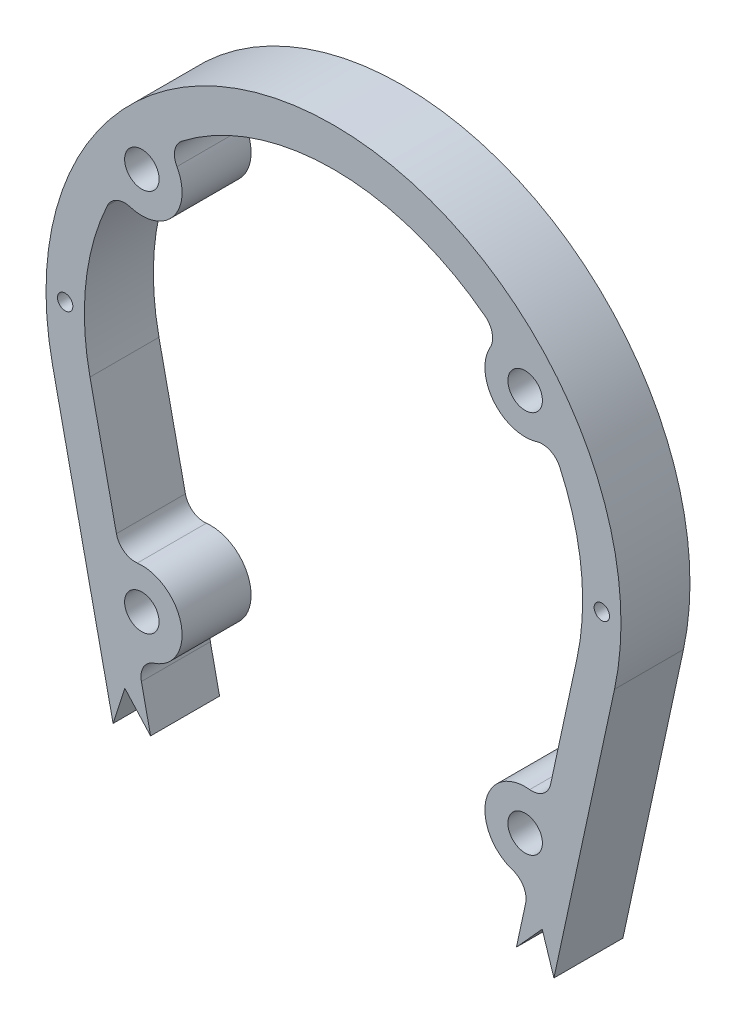
ISO-10303-21;
HEADER;
FILE_DESCRIPTION(('STEP AP214'),'2;1');
FILE_NAME('part.step','',(''),(''),'','','');
FILE_SCHEMA(('AUTOMOTIVE_DESIGN { 1 0 10303 214 1 1 1 1 }'));
ENDSEC;
DATA;
#1=APPLICATION_CONTEXT('core data for automotive mechanical design processes');
#2=APPLICATION_PROTOCOL_DEFINITION('international standard','automotive_design',2000,#1);
#3=PRODUCT_CONTEXT('',#1,'mechanical');
#4=PRODUCT('Part','Part','',(#3));
#5=PRODUCT_RELATED_PRODUCT_CATEGORY('part','',(#4));
#6=PRODUCT_DEFINITION_FORMATION('','',#4);
#7=PRODUCT_DEFINITION_CONTEXT('part definition',#1,'design');
#8=PRODUCT_DEFINITION('design','',#6,#7);
#9=PRODUCT_DEFINITION_SHAPE('','',#8);
#10=(LENGTH_UNIT() NAMED_UNIT(*) SI_UNIT(.MILLI.,.METRE.));
#11=(NAMED_UNIT(*) PLANE_ANGLE_UNIT() SI_UNIT($,.RADIAN.));
#12=(NAMED_UNIT(*) SI_UNIT($,.STERADIAN.) SOLID_ANGLE_UNIT());
#13=UNCERTAINTY_MEASURE_WITH_UNIT(LENGTH_MEASURE(1.E-05),#10,'distance_accuracy_value','');
#14=(GEOMETRIC_REPRESENTATION_CONTEXT(3) GLOBAL_UNCERTAINTY_ASSIGNED_CONTEXT((#13)) GLOBAL_UNIT_ASSIGNED_CONTEXT((#10,
#11,#12)) REPRESENTATION_CONTEXT('',''));
#15=CARTESIAN_POINT('',(0.,0.,0.));
#16=DIRECTION('',(0.,0.,1.));
#17=DIRECTION('',(1.,0.,0.));
#18=AXIS2_PLACEMENT_3D('',#15,#16,#17);
#19=CARTESIAN_POINT('',(-31.9298733487398,-112.5,18.));
#20=DIRECTION('',(0.,0.,1.));
#21=DIRECTION('',(1.,0.,0.));
#22=AXIS2_PLACEMENT_3D('',#19,#20,#21);
#23=PLANE('',#22);
#24=CARTESIAN_POINT('',(70.,47.5,18.));
#25=DIRECTION('',(0.,0.,1.));
#26=DIRECTION('',(1.,0.,0.));
#27=AXIS2_PLACEMENT_3D('',#24,#25,#26);
#28=CIRCLE('',#27,2.);
#29=CARTESIAN_POINT('',(72.,47.5,18.));
#30=VERTEX_POINT('',#29);
#31=EDGE_CURVE('E555',#30,#30,#28,.T.);
#32=ORIENTED_EDGE('',*,*,#31,.F.);
#33=EDGE_LOOP('',(#32));
#34=FACE_BOUND('',#33,.T.);
#35=CARTESIAN_POINT('',(-70.,47.5,18.));
#36=DIRECTION('',(0.,0.,1.));
#37=DIRECTION('',(1.,0.,0.));
#38=AXIS2_PLACEMENT_3D('',#35,#36,#37);
#39=CIRCLE('',#38,2.);
#40=CARTESIAN_POINT('',(-68.,47.5,18.));
#41=VERTEX_POINT('',#40);
#42=EDGE_CURVE('E549',#41,#41,#39,.T.);
#43=ORIENTED_EDGE('',*,*,#42,.F.);
#44=EDGE_LOOP('',(#43));
#45=FACE_BOUND('',#44,.T.);
#46=DIRECTION('',(-0.306753150837407,-0.95178910713,0.));
#47=VECTOR('',#46,1.);
#48=CARTESIAN_POINT('',(-57.5063561450649,-41.4755483598365,18.));
#49=LINE('',#48,#47);
#50=CARTESIAN_POINT('',(-54.4439824625953,-31.9736609139237,18.));
#51=VERTEX_POINT('',#50);
#52=CARTESIAN_POINT('',(-57.5063561450649,-41.4755483598365,18.));
#53=VERTEX_POINT('',#52);
#54=EDGE_CURVE('E215',#51,#53,#49,.T.);
#55=ORIENTED_EDGE('',*,*,#54,.F.);
#56=DIRECTION('',(-0.67089697040122,0.741550574881083,0.));
#57=VECTOR('',#56,1.);
#58=CARTESIAN_POINT('',(-54.4439824625953,-31.9736609139237,18.));
#59=LINE('',#58,#57);
#60=CARTESIAN_POINT('',(-47.7236876934698,-39.4016843948391,18.));
#61=VERTEX_POINT('',#60);
#62=EDGE_CURVE('E540',#61,#51,#59,.T.);
#63=ORIENTED_EDGE('',*,*,#62,.F.);
#64=DIRECTION('',(0.211189373172623,-0.977445164016353,0.));
#65=VECTOR('',#64,1.);
#66=CARTESIAN_POINT('',(-31.9298733487398,-112.5,18.));
#67=LINE('',#66,#65);
#68=CARTESIAN_POINT('',(-50.1212592306133,-28.3050337009208,18.));
#69=VERTEX_POINT('',#68);
#70=EDGE_CURVE('E361',#69,#61,#67,.T.);
#71=ORIENTED_EDGE('',*,*,#70,.F.);
#72=CARTESIAN_POINT('',(-45.2340334105316,-27.2490868350576,18.));
#73=DIRECTION('',(0.,0.,1.));
#74=DIRECTION('',(1.,0.,0.));
#75=AXIS2_PLACEMENT_3D('',#72,#73,#74);
#76=CIRCLE('',#75,5.);
#77=CARTESIAN_POINT('',(-46.7714419877795,-22.4913168882649,18.));
#78=VERTEX_POINT('',#77);
#79=EDGE_CURVE('E303',#69,#78,#76,.F.);
#80=ORIENTED_EDGE('',*,*,#79,.T.);
#81=CARTESIAN_POINT('',(-50.,-12.5,18.));
#82=DIRECTION('',(0.,0.,-1.));
#83=DIRECTION('',(1.,0.,0.));
#84=AXIS2_PLACEMENT_3D('',#81,#82,#83);
#85=CIRCLE('',#84,10.5);
#86=CARTESIAN_POINT('',(-51.1843712947804,-2.06701075261266,18.));
#87=VERTEX_POINT('',#86);
#88=EDGE_CURVE('E358',#87,#78,#85,.T.);
#89=ORIENTED_EDGE('',*,*,#88,.F.);
#90=CARTESIAN_POINT('',(-51.7483576256283,2.90107936519085,18.));
#91=DIRECTION('',(0.,0.,1.));
#92=DIRECTION('',(1.,0.,0.));
#93=AXIS2_PLACEMENT_3D('',#90,#91,#92);
#94=CIRCLE('',#93,5.);
#95=CARTESIAN_POINT('',(-56.63558344571,1.84513249932773,18.));
#96=VERTEX_POINT('',#95);
#97=EDGE_CURVE('E290',#87,#96,#94,.F.);
#98=ORIENTED_EDGE('',*,*,#97,.T.);
#99=DIRECTION('',(0.211189373172623,-0.977445164016353,0.));
#100=VECTOR('',#99,1.);
#101=CARTESIAN_POINT('',(-55.4723236772757,-3.53876830055558,18.));
#102=LINE('',#101,#100);
#103=CARTESIAN_POINT('',(-63.5339356610629,33.7726907437795,18.));
#104=VERTEX_POINT('',#103);
#105=EDGE_CURVE('E349',#104,#96,#102,.T.);
#106=ORIENTED_EDGE('',*,*,#105,.F.);
#107=CARTESIAN_POINT('',(0.,47.5,18.));
#108=DIRECTION('',(0.,0.,1.));
#109=DIRECTION('',(1.,0.,0.));
#110=AXIS2_PLACEMENT_3D('',#107,#108,#109);
#111=CIRCLE('',#110,65.);
#112=CARTESIAN_POINT('',(-59.0097536999229,74.755255791763,18.));
#113=VERTEX_POINT('',#112);
#114=EDGE_CURVE('E343',#113,#104,#111,.T.);
#115=ORIENTED_EDGE('',*,*,#114,.F.);
#116=CARTESIAN_POINT('',(-54.4705418768519,72.6586976539351,18.));
#117=DIRECTION('',(0.,0.,1.));
#118=DIRECTION('',(1.,0.,0.));
#119=AXIS2_PLACEMENT_3D('',#116,#117,#118);
#120=CIRCLE('',#119,5.);
#121=CARTESIAN_POINT('',(-53.0284315939965,77.4462145397625,18.));
#122=VERTEX_POINT('',#121);
#123=EDGE_CURVE('E11',#113,#122,#120,.F.);
#124=ORIENTED_EDGE('',*,*,#123,.T.);
#125=CARTESIAN_POINT('',(-50.,87.5,18.));
#126=DIRECTION('',(0.,0.,-1.));
#127=DIRECTION('',(1.,0.,0.));
#128=AXIS2_PLACEMENT_3D('',#125,#126,#127);
#129=CIRCLE('',#128,10.5);
#130=CARTESIAN_POINT('',(-40.8562064862553,92.661495924439,18.));
#131=VERTEX_POINT('',#130);
#132=EDGE_CURVE('E340',#131,#122,#129,.T.);
#133=ORIENTED_EDGE('',*,*,#132,.F.);
#134=CARTESIAN_POINT('',(-36.5020190987578,95.1193511265528,18.));
#135=DIRECTION('',(0.,0.,1.));
#136=DIRECTION('',(1.,0.,0.));
#137=AXIS2_PLACEMENT_3D('',#134,#135,#136);
#138=CIRCLE('',#137,5.);
#139=CARTESIAN_POINT('',(-39.5438540236543,99.0876303870988,18.));
#140=VERTEX_POINT('',#139);
#141=EDGE_CURVE('E315',#131,#140,#138,.F.);
#142=ORIENTED_EDGE('',*,*,#141,.T.);
#143=CARTESIAN_POINT('',(0.,47.5,18.));
#144=DIRECTION('',(0.,0.,1.));
#145=DIRECTION('',(1.,0.,0.));
#146=AXIS2_PLACEMENT_3D('',#143,#144,#145);
#147=CIRCLE('',#146,65.);
#148=CARTESIAN_POINT('',(39.5438540236543,99.0876303870988,18.));
#149=VERTEX_POINT('',#148);
#150=EDGE_CURVE('E347',#149,#140,#147,.T.);
#151=ORIENTED_EDGE('',*,*,#150,.F.);
#152=CARTESIAN_POINT('',(36.5020190987578,95.1193511265527,18.));
#153=DIRECTION('',(0.,0.,1.));
#154=DIRECTION('',(1.,0.,0.));
#155=AXIS2_PLACEMENT_3D('',#152,#153,#154);
#156=CIRCLE('',#155,5.);
#157=CARTESIAN_POINT('',(40.8562064862553,92.6614959244389,18.));
#158=VERTEX_POINT('',#157);
#159=EDGE_CURVE('E311',#149,#158,#156,.F.);
#160=ORIENTED_EDGE('',*,*,#159,.T.);
#161=CARTESIAN_POINT('',(50.,87.5,18.));
#162=DIRECTION('',(0.,0.,-1.));
#163=DIRECTION('',(1.,0.,0.));
#164=AXIS2_PLACEMENT_3D('',#161,#162,#163);
#165=CIRCLE('',#164,10.5);
#166=CARTESIAN_POINT('',(53.0284315939965,77.4462145397625,18.));
#167=VERTEX_POINT('',#166);
#168=EDGE_CURVE('E352',#167,#158,#165,.T.);
#169=ORIENTED_EDGE('',*,*,#168,.F.);
#170=CARTESIAN_POINT('',(54.470541876852,72.6586976539351,18.));
#171=DIRECTION('',(0.,0.,1.));
#172=DIRECTION('',(1.,0.,0.));
#173=AXIS2_PLACEMENT_3D('',#170,#171,#172);
#174=CIRCLE('',#173,5.);
#175=CARTESIAN_POINT('',(59.009753699923,74.755255791763,18.));
#176=VERTEX_POINT('',#175);
#177=EDGE_CURVE('E307',#167,#176,#174,.F.);
#178=ORIENTED_EDGE('',*,*,#177,.T.);
#179=CARTESIAN_POINT('',(0.,47.5,18.));
#180=DIRECTION('',(0.,0.,1.));
#181=DIRECTION('',(1.,0.,0.));
#182=AXIS2_PLACEMENT_3D('',#179,#180,#181);
#183=CIRCLE('',#182,65.);
#184=CARTESIAN_POINT('',(63.5339356610629,33.7726907437795,18.));
#185=VERTEX_POINT('',#184);
#186=EDGE_CURVE('E443',#185,#176,#183,.T.);
#187=ORIENTED_EDGE('',*,*,#186,.F.);
#188=DIRECTION('',(0.211189373172623,0.977445164016353,0.));
#189=VECTOR('',#188,1.);
#190=CARTESIAN_POINT('',(55.4723236772757,-3.53876830055554,18.));
#191=LINE('',#190,#189);
#192=CARTESIAN_POINT('',(56.63558344571,1.84513249932773,18.));
#193=VERTEX_POINT('',#192);
#194=EDGE_CURVE('E441',#193,#185,#191,.T.);
#195=ORIENTED_EDGE('',*,*,#194,.F.);
#196=CARTESIAN_POINT('',(51.7483576256282,2.90107936519085,18.));
#197=DIRECTION('',(0.,0.,1.));
#198=DIRECTION('',(1.,0.,0.));
#199=AXIS2_PLACEMENT_3D('',#196,#197,#198);
#200=CIRCLE('',#199,5.);
#201=CARTESIAN_POINT('',(51.1843712947804,-2.06701075261265,18.));
#202=VERTEX_POINT('',#201);
#203=EDGE_CURVE('E294',#193,#202,#200,.F.);
#204=ORIENTED_EDGE('',*,*,#203,.T.);
#205=CARTESIAN_POINT('',(50.,-12.5,18.));
#206=DIRECTION('',(0.,0.,-1.));
#207=DIRECTION('',(1.,0.,0.));
#208=AXIS2_PLACEMENT_3D('',#205,#206,#207);
#209=CIRCLE('',#208,10.5);
#210=CARTESIAN_POINT('',(46.7714419877795,-22.4913168882648,18.));
#211=VERTEX_POINT('',#210);
#212=EDGE_CURVE('E391',#211,#202,#209,.T.);
#213=ORIENTED_EDGE('',*,*,#212,.F.);
#214=CARTESIAN_POINT('',(45.2340334105316,-27.2490868350576,18.));
#215=DIRECTION('',(0.,0.,1.));
#216=DIRECTION('',(1.,0.,0.));
#217=AXIS2_PLACEMENT_3D('',#214,#215,#216);
#218=CIRCLE('',#217,5.);
#219=CARTESIAN_POINT('',(50.1212592306133,-28.3050337009207,18.));
#220=VERTEX_POINT('',#219);
#221=EDGE_CURVE('E298',#211,#220,#218,.F.);
#222=ORIENTED_EDGE('',*,*,#221,.T.);
#223=DIRECTION('',(0.211189373172623,0.977445164016353,0.));
#224=VECTOR('',#223,1.);
#225=CARTESIAN_POINT('',(31.9298733487398,-112.5,18.));
#226=LINE('',#225,#224);
#227=CARTESIAN_POINT('',(47.7244032118376,-39.3983727700264,18.));
#228=VERTEX_POINT('',#227);
#229=EDGE_CURVE('E364',#228,#220,#226,.T.);
#230=ORIENTED_EDGE('',*,*,#229,.F.);
#231=DIRECTION('',(-0.670959777554308,-0.741493747043273,0.));
#232=VECTOR('',#231,1.);
#233=CARTESIAN_POINT('',(47.7244032118376,-39.3983727700264,18.));
#234=LINE('',#233,#232);
#235=CARTESIAN_POINT('',(54.4443390688109,-31.9720104377862,18.));
#236=VERTEX_POINT('',#235);
#237=EDGE_CURVE('E55',#236,#228,#234,.T.);
#238=ORIENTED_EDGE('',*,*,#237,.F.);
#239=DIRECTION('',(-0.306672532909785,0.951815085801174,0.));
#240=VECTOR('',#239,1.);
#241=CARTESIAN_POINT('',(54.4443390688109,-31.9720104377862,18.));
#242=LINE('',#241,#240);
#243=CARTESIAN_POINT('',(57.5063561450649,-41.4755483598365,18.));
#244=VERTEX_POINT('',#243);
#245=EDGE_CURVE('E539',#244,#236,#242,.T.);
#246=ORIENTED_EDGE('',*,*,#245,.F.);
#247=DIRECTION('',(0.211189373172623,0.977445164016353,0.));
#248=VECTOR('',#247,1.);
#249=CARTESIAN_POINT('',(41.7043249889033,-114.611893731726,18.));
#250=LINE('',#249,#248);
#251=CARTESIAN_POINT('',(73.3083873012265,31.6607970120533,18.));
#252=VERTEX_POINT('',#251);
#253=EDGE_CURVE('E223',#244,#252,#250,.T.);
#254=ORIENTED_EDGE('',*,*,#253,.T.);
#255=CARTESIAN_POINT('',(0.,47.5,18.));
#256=DIRECTION('',(0.,0.,1.));
#257=DIRECTION('',(1.,0.,0.));
#258=AXIS2_PLACEMENT_3D('',#255,#256,#257);
#259=CIRCLE('',#258,75.);
#260=CARTESIAN_POINT('',(-73.3083873012264,31.6607970120533,18.));
#261=VERTEX_POINT('',#260);
#262=EDGE_CURVE('E416',#252,#261,#259,.T.);
#263=ORIENTED_EDGE('',*,*,#262,.T.);
#264=DIRECTION('',(0.211189373172623,-0.977445164016353,0.));
#265=VECTOR('',#264,1.);
#266=CARTESIAN_POINT('',(-73.3083873012264,31.6607970120533,18.));
#267=LINE('',#266,#265);
#268=EDGE_CURVE('E238',#261,#53,#267,.T.);
#269=ORIENTED_EDGE('',*,*,#268,.T.);
#270=EDGE_LOOP('',(#55,#63,#71,#80,#89,#98,#106,#115,#124,#133,#142,#151,#160,#169,#178,#187,
#195,#204,#213,#222,#230,#238,#246,#254,#263,#269));
#271=FACE_BOUND('',#270,.T.);
#272=CARTESIAN_POINT('',(-50.,87.5,18.));
#273=DIRECTION('',(0.,0.,1.));
#274=DIRECTION('',(1.,0.,0.));
#275=AXIS2_PLACEMENT_3D('',#272,#273,#274);
#276=CIRCLE('',#275,4.5);
#277=CARTESIAN_POINT('',(-45.5,87.5,18.));
#278=VERTEX_POINT('',#277);
#279=EDGE_CURVE('E403',#278,#278,#276,.T.);
#280=ORIENTED_EDGE('',*,*,#279,.F.);
#281=EDGE_LOOP('',(#280));
#282=FACE_BOUND('',#281,.T.);
#283=CARTESIAN_POINT('',(50.,-12.5,18.));
#284=DIRECTION('',(0.,0.,1.));
#285=DIRECTION('',(1.,0.,0.));
#286=AXIS2_PLACEMENT_3D('',#283,#284,#285);
#287=CIRCLE('',#286,4.5);
#288=CARTESIAN_POINT('',(54.5,-12.5,18.));
#289=VERTEX_POINT('',#288);
#290=EDGE_CURVE('E230',#289,#289,#287,.T.);
#291=ORIENTED_EDGE('',*,*,#290,.F.);
#292=EDGE_LOOP('',(#291));
#293=FACE_BOUND('',#292,.T.);
#294=CARTESIAN_POINT('',(50.,87.5,18.));
#295=DIRECTION('',(0.,0.,1.));
#296=DIRECTION('',(1.,0.,0.));
#297=AXIS2_PLACEMENT_3D('',#294,#295,#296);
#298=CIRCLE('',#297,4.5);
#299=CARTESIAN_POINT('',(54.5,87.5,18.));
#300=VERTEX_POINT('',#299);
#301=EDGE_CURVE('E409',#300,#300,#298,.T.);
#302=ORIENTED_EDGE('',*,*,#301,.F.);
#303=EDGE_LOOP('',(#302));
#304=FACE_BOUND('',#303,.T.);
#305=CARTESIAN_POINT('',(-50.,-12.5,18.));
#306=DIRECTION('',(0.,0.,1.));
#307=DIRECTION('',(1.,0.,0.));
#308=AXIS2_PLACEMENT_3D('',#305,#306,#307);
#309=CIRCLE('',#308,4.5);
#310=CARTESIAN_POINT('',(-45.5,-12.5,18.));
#311=VERTEX_POINT('',#310);
#312=EDGE_CURVE('E397',#311,#311,#309,.T.);
#313=ORIENTED_EDGE('',*,*,#312,.F.);
#314=EDGE_LOOP('',(#313));
#315=FACE_BOUND('',#314,.T.);
#316=ADVANCED_FACE('F32',(#34,#45,#271,#282,#293,#304,#315),#23,.T.);
#317=CARTESIAN_POINT('',(-31.9298733487398,-112.5,0.));
#318=DIRECTION('',(0.,0.,1.));
#319=DIRECTION('',(1.,0.,0.));
#320=AXIS2_PLACEMENT_3D('',#317,#318,#319);
#321=PLANE('',#320);
#322=CARTESIAN_POINT('',(70.,47.5,0.));
#323=DIRECTION('',(0.,0.,1.));
#324=DIRECTION('',(1.,0.,0.));
#325=AXIS2_PLACEMENT_3D('',#322,#323,#324);
#326=CIRCLE('',#325,2.);
#327=CARTESIAN_POINT('',(72.,47.5,0.));
#328=VERTEX_POINT('',#327);
#329=EDGE_CURVE('E552',#328,#328,#326,.T.);
#330=ORIENTED_EDGE('',*,*,#329,.T.);
#331=EDGE_LOOP('',(#330));
#332=FACE_BOUND('',#331,.T.);
#333=CARTESIAN_POINT('',(-70.,47.5,0.));
#334=DIRECTION('',(0.,0.,1.));
#335=DIRECTION('',(1.,0.,0.));
#336=AXIS2_PLACEMENT_3D('',#333,#334,#335);
#337=CIRCLE('',#336,2.);
#338=CARTESIAN_POINT('',(-68.,47.5,0.));
#339=VERTEX_POINT('',#338);
#340=EDGE_CURVE('E543',#339,#339,#337,.T.);
#341=ORIENTED_EDGE('',*,*,#340,.T.);
#342=EDGE_LOOP('',(#341));
#343=FACE_BOUND('',#342,.T.);
#344=CARTESIAN_POINT('',(-50.,-12.5,0.));
#345=DIRECTION('',(0.,0.,1.));
#346=DIRECTION('',(1.,0.,0.));
#347=AXIS2_PLACEMENT_3D('',#344,#345,#346);
#348=CIRCLE('',#347,4.5);
#349=CARTESIAN_POINT('',(-45.5,-12.5,0.));
#350=VERTEX_POINT('',#349);
#351=EDGE_CURVE('E396',#350,#350,#348,.T.);
#352=ORIENTED_EDGE('',*,*,#351,.T.);
#353=EDGE_LOOP('',(#352));
#354=FACE_BOUND('',#353,.T.);
#355=CARTESIAN_POINT('',(-50.,87.5,0.));
#356=DIRECTION('',(0.,0.,1.));
#357=DIRECTION('',(1.,0.,0.));
#358=AXIS2_PLACEMENT_3D('',#355,#356,#357);
#359=CIRCLE('',#358,4.5);
#360=CARTESIAN_POINT('',(-45.5,87.5,0.));
#361=VERTEX_POINT('',#360);
#362=EDGE_CURVE('E400',#361,#361,#359,.T.);
#363=ORIENTED_EDGE('',*,*,#362,.T.);
#364=EDGE_LOOP('',(#363));
#365=FACE_BOUND('',#364,.T.);
#366=CARTESIAN_POINT('',(50.,87.5,0.));
#367=DIRECTION('',(0.,0.,1.));
#368=DIRECTION('',(1.,0.,0.));
#369=AXIS2_PLACEMENT_3D('',#366,#367,#368);
#370=CIRCLE('',#369,4.5);
#371=CARTESIAN_POINT('',(54.5,87.5,0.));
#372=VERTEX_POINT('',#371);
#373=EDGE_CURVE('E406',#372,#372,#370,.T.);
#374=ORIENTED_EDGE('',*,*,#373,.T.);
#375=EDGE_LOOP('',(#374));
#376=FACE_BOUND('',#375,.T.);
#377=CARTESIAN_POINT('',(50.,-12.5,0.));
#378=DIRECTION('',(0.,0.,1.));
#379=DIRECTION('',(1.,0.,0.));
#380=AXIS2_PLACEMENT_3D('',#377,#378,#379);
#381=CIRCLE('',#380,4.5);
#382=CARTESIAN_POINT('',(54.5,-12.5,0.));
#383=VERTEX_POINT('',#382);
#384=EDGE_CURVE('E235',#383,#383,#381,.T.);
#385=ORIENTED_EDGE('',*,*,#384,.T.);
#386=EDGE_LOOP('',(#385));
#387=FACE_BOUND('',#386,.T.);
#388=DIRECTION('',(-0.67089697040122,0.741550574881083,0.));
#389=VECTOR('',#388,1.);
#390=CARTESIAN_POINT('',(-54.4439824625953,-31.9736609139237,0.));
#391=LINE('',#390,#389);
#392=CARTESIAN_POINT('',(-47.7236876934698,-39.4016843948391,0.));
#393=VERTEX_POINT('',#392);
#394=CARTESIAN_POINT('',(-54.4439824625953,-31.9736609139237,0.));
#395=VERTEX_POINT('',#394);
#396=EDGE_CURVE('E47',#393,#395,#391,.T.);
#397=ORIENTED_EDGE('',*,*,#396,.T.);
#398=DIRECTION('',(-0.306753150837407,-0.95178910713,0.));
#399=VECTOR('',#398,1.);
#400=CARTESIAN_POINT('',(-57.5063561450649,-41.4755483598365,0.));
#401=LINE('',#400,#399);
#402=CARTESIAN_POINT('',(-57.5063561450649,-41.4755483598365,0.));
#403=VERTEX_POINT('',#402);
#404=EDGE_CURVE('E224',#395,#403,#401,.T.);
#405=ORIENTED_EDGE('',*,*,#404,.T.);
#406=DIRECTION('',(0.211189373172623,-0.977445164016353,0.));
#407=VECTOR('',#406,1.);
#408=CARTESIAN_POINT('',(-73.3083873012264,31.6607970120533,0.));
#409=LINE('',#408,#407);
#410=CARTESIAN_POINT('',(-73.3083873012264,31.6607970120533,0.));
#411=VERTEX_POINT('',#410);
#412=EDGE_CURVE('E232',#411,#403,#409,.T.);
#413=ORIENTED_EDGE('',*,*,#412,.F.);
#414=CARTESIAN_POINT('',(0.,47.5,0.));
#415=DIRECTION('',(0.,0.,1.));
#416=DIRECTION('',(1.,0.,0.));
#417=AXIS2_PLACEMENT_3D('',#414,#415,#416);
#418=CIRCLE('',#417,75.);
#419=CARTESIAN_POINT('',(73.3083873012265,31.6607970120533,0.));
#420=VERTEX_POINT('',#419);
#421=EDGE_CURVE('E229',#420,#411,#418,.T.);
#422=ORIENTED_EDGE('',*,*,#421,.F.);
#423=DIRECTION('',(0.211189373172623,0.977445164016353,0.));
#424=VECTOR('',#423,1.);
#425=CARTESIAN_POINT('',(41.7043249889033,-114.611893731726,0.));
#426=LINE('',#425,#424);
#427=CARTESIAN_POINT('',(57.5063561450649,-41.4755483598365,0.));
#428=VERTEX_POINT('',#427);
#429=EDGE_CURVE('E221',#428,#420,#426,.T.);
#430=ORIENTED_EDGE('',*,*,#429,.F.);
#431=DIRECTION('',(-0.306672532909785,0.951815085801174,0.));
#432=VECTOR('',#431,1.);
#433=CARTESIAN_POINT('',(54.4443390688109,-31.9720104377862,0.));
#434=LINE('',#433,#432);
#435=CARTESIAN_POINT('',(54.4443390688109,-31.9720104377862,0.));
#436=VERTEX_POINT('',#435);
#437=EDGE_CURVE('E203',#428,#436,#434,.T.);
#438=ORIENTED_EDGE('',*,*,#437,.T.);
#439=DIRECTION('',(-0.670959777554308,-0.741493747043273,0.));
#440=VECTOR('',#439,1.);
#441=CARTESIAN_POINT('',(47.7244032118376,-39.3983727700264,0.));
#442=LINE('',#441,#440);
#443=CARTESIAN_POINT('',(47.7244032118376,-39.3983727700264,0.));
#444=VERTEX_POINT('',#443);
#445=EDGE_CURVE('E214',#436,#444,#442,.T.);
#446=ORIENTED_EDGE('',*,*,#445,.T.);
#447=DIRECTION('',(0.211189373172623,0.977445164016353,0.));
#448=VECTOR('',#447,1.);
#449=CARTESIAN_POINT('',(31.9298733487398,-112.5,0.));
#450=LINE('',#449,#448);
#451=CARTESIAN_POINT('',(50.1212592306133,-28.3050337009207,0.));
#452=VERTEX_POINT('',#451);
#453=EDGE_CURVE('E389',#444,#452,#450,.T.);
#454=ORIENTED_EDGE('',*,*,#453,.T.);
#455=CARTESIAN_POINT('',(45.2340334105316,-27.2490868350576,0.));
#456=DIRECTION('',(0.,0.,1.));
#457=DIRECTION('',(1.,0.,0.));
#458=AXIS2_PLACEMENT_3D('',#455,#456,#457);
#459=CIRCLE('',#458,5.);
#460=CARTESIAN_POINT('',(46.7714419877795,-22.4913168882648,0.));
#461=VERTEX_POINT('',#460);
#462=EDGE_CURVE('E296',#452,#461,#459,.T.);
#463=ORIENTED_EDGE('',*,*,#462,.T.);
#464=CARTESIAN_POINT('',(50.,-12.5,0.));
#465=DIRECTION('',(0.,0.,-1.));
#466=DIRECTION('',(1.,0.,0.));
#467=AXIS2_PLACEMENT_3D('',#464,#465,#466);
#468=CIRCLE('',#467,10.5);
#469=CARTESIAN_POINT('',(51.1843712947804,-2.06701075261265,0.));
#470=VERTEX_POINT('',#469);
#471=EDGE_CURVE('E366',#461,#470,#468,.T.);
#472=ORIENTED_EDGE('',*,*,#471,.T.);
#473=CARTESIAN_POINT('',(51.7483576256282,2.90107936519085,0.));
#474=DIRECTION('',(0.,0.,1.));
#475=DIRECTION('',(1.,0.,0.));
#476=AXIS2_PLACEMENT_3D('',#473,#474,#475);
#477=CIRCLE('',#476,5.);
#478=CARTESIAN_POINT('',(56.63558344571,1.84513249932773,0.));
#479=VERTEX_POINT('',#478);
#480=EDGE_CURVE('E292',#470,#479,#477,.T.);
#481=ORIENTED_EDGE('',*,*,#480,.T.);
#482=DIRECTION('',(0.211189373172623,0.977445164016353,0.));
#483=VECTOR('',#482,1.);
#484=CARTESIAN_POINT('',(55.4723236772757,-3.53876830055554,0.));
#485=LINE('',#484,#483);
#486=CARTESIAN_POINT('',(63.5339356610629,33.7726907437795,0.));
#487=VERTEX_POINT('',#486);
#488=EDGE_CURVE('E369',#479,#487,#485,.T.);
#489=ORIENTED_EDGE('',*,*,#488,.T.);
#490=CARTESIAN_POINT('',(0.,47.5,0.));
#491=DIRECTION('',(0.,0.,1.));
#492=DIRECTION('',(1.,0.,0.));
#493=AXIS2_PLACEMENT_3D('',#490,#491,#492);
#494=CIRCLE('',#493,65.);
#495=CARTESIAN_POINT('',(59.009753699923,74.755255791763,0.));
#496=VERTEX_POINT('',#495);
#497=EDGE_CURVE('E372',#487,#496,#494,.T.);
#498=ORIENTED_EDGE('',*,*,#497,.T.);
#499=CARTESIAN_POINT('',(54.470541876852,72.6586976539351,0.));
#500=DIRECTION('',(0.,0.,1.));
#501=DIRECTION('',(1.,0.,0.));
#502=AXIS2_PLACEMENT_3D('',#499,#500,#501);
#503=CIRCLE('',#502,5.);
#504=CARTESIAN_POINT('',(53.0284315939965,77.4462145397625,0.));
#505=VERTEX_POINT('',#504);
#506=EDGE_CURVE('E305',#496,#505,#503,.T.);
#507=ORIENTED_EDGE('',*,*,#506,.T.);
#508=CARTESIAN_POINT('',(50.,87.5,0.));
#509=DIRECTION('',(0.,0.,-1.));
#510=DIRECTION('',(1.,0.,0.));
#511=AXIS2_PLACEMENT_3D('',#508,#509,#510);
#512=CIRCLE('',#511,10.5);
#513=CARTESIAN_POINT('',(40.8562064862553,92.6614959244389,0.));
#514=VERTEX_POINT('',#513);
#515=EDGE_CURVE('E375',#505,#514,#512,.T.);
#516=ORIENTED_EDGE('',*,*,#515,.T.);
#517=CARTESIAN_POINT('',(36.5020190987578,95.1193511265527,0.));
#518=DIRECTION('',(0.,0.,1.));
#519=DIRECTION('',(1.,0.,0.));
#520=AXIS2_PLACEMENT_3D('',#517,#518,#519);
#521=CIRCLE('',#520,5.);
#522=CARTESIAN_POINT('',(39.5438540236543,99.0876303870988,0.));
#523=VERTEX_POINT('',#522);
#524=EDGE_CURVE('E309',#514,#523,#521,.T.);
#525=ORIENTED_EDGE('',*,*,#524,.T.);
#526=CARTESIAN_POINT('',(0.,47.5,0.));
#527=DIRECTION('',(0.,0.,1.));
#528=DIRECTION('',(1.,0.,0.));
#529=AXIS2_PLACEMENT_3D('',#526,#527,#528);
#530=CIRCLE('',#529,65.);
#531=CARTESIAN_POINT('',(-39.5438540236543,99.0876303870988,0.));
#532=VERTEX_POINT('',#531);
#533=EDGE_CURVE('E378',#523,#532,#530,.T.);
#534=ORIENTED_EDGE('',*,*,#533,.T.);
#535=CARTESIAN_POINT('',(-36.5020190987578,95.1193511265528,0.));
#536=DIRECTION('',(0.,0.,1.));
#537=DIRECTION('',(1.,0.,0.));
#538=AXIS2_PLACEMENT_3D('',#535,#536,#537);
#539=CIRCLE('',#538,5.);
#540=CARTESIAN_POINT('',(-40.8562064862553,92.661495924439,0.));
#541=VERTEX_POINT('',#540);
#542=EDGE_CURVE('E313',#532,#541,#539,.T.);
#543=ORIENTED_EDGE('',*,*,#542,.T.);
#544=CARTESIAN_POINT('',(-50.,87.5,0.));
#545=DIRECTION('',(0.,0.,-1.));
#546=DIRECTION('',(1.,0.,0.));
#547=AXIS2_PLACEMENT_3D('',#544,#545,#546);
#548=CIRCLE('',#547,10.5);
#549=CARTESIAN_POINT('',(-53.0284315939965,77.4462145397625,0.));
#550=VERTEX_POINT('',#549);
#551=EDGE_CURVE('E322',#541,#550,#548,.T.);
#552=ORIENTED_EDGE('',*,*,#551,.T.);
#553=CARTESIAN_POINT('',(-54.4705418768519,72.6586976539351,0.));
#554=DIRECTION('',(0.,0.,1.));
#555=DIRECTION('',(1.,0.,0.));
#556=AXIS2_PLACEMENT_3D('',#553,#554,#555);
#557=CIRCLE('',#556,5.);
#558=CARTESIAN_POINT('',(-59.0097536999229,74.755255791763,0.));
#559=VERTEX_POINT('',#558);
#560=EDGE_CURVE('E40',#550,#559,#557,.T.);
#561=ORIENTED_EDGE('',*,*,#560,.T.);
#562=CARTESIAN_POINT('',(0.,47.5,0.));
#563=DIRECTION('',(0.,0.,1.));
#564=DIRECTION('',(1.,0.,0.));
#565=AXIS2_PLACEMENT_3D('',#562,#563,#564);
#566=CIRCLE('',#565,65.);
#567=CARTESIAN_POINT('',(-63.5339356610629,33.7726907437795,0.));
#568=VERTEX_POINT('',#567);
#569=EDGE_CURVE('E319',#559,#568,#566,.T.);
#570=ORIENTED_EDGE('',*,*,#569,.T.);
#571=DIRECTION('',(0.211189373172623,-0.977445164016353,0.));
#572=VECTOR('',#571,1.);
#573=CARTESIAN_POINT('',(-55.4723236772757,-3.53876830055558,0.));
#574=LINE('',#573,#572);
#575=CARTESIAN_POINT('',(-56.63558344571,1.84513249932773,0.));
#576=VERTEX_POINT('',#575);
#577=EDGE_CURVE('E332',#568,#576,#574,.T.);
#578=ORIENTED_EDGE('',*,*,#577,.T.);
#579=CARTESIAN_POINT('',(-51.7483576256283,2.90107936519085,0.));
#580=DIRECTION('',(0.,0.,1.));
#581=DIRECTION('',(1.,0.,0.));
#582=AXIS2_PLACEMENT_3D('',#579,#580,#581);
#583=CIRCLE('',#582,5.);
#584=CARTESIAN_POINT('',(-51.1843712947804,-2.06701075261266,0.));
#585=VERTEX_POINT('',#584);
#586=EDGE_CURVE('E288',#576,#585,#583,.T.);
#587=ORIENTED_EDGE('',*,*,#586,.T.);
#588=CARTESIAN_POINT('',(-50.,-12.5,0.));
#589=DIRECTION('',(0.,0.,-1.));
#590=DIRECTION('',(1.,0.,0.));
#591=AXIS2_PLACEMENT_3D('',#588,#589,#590);
#592=CIRCLE('',#591,10.5);
#593=CARTESIAN_POINT('',(-46.7714419877795,-22.4913168882649,0.));
#594=VERTEX_POINT('',#593);
#595=EDGE_CURVE('E383',#585,#594,#592,.T.);
#596=ORIENTED_EDGE('',*,*,#595,.T.);
#597=CARTESIAN_POINT('',(-45.2340334105316,-27.2490868350576,0.));
#598=DIRECTION('',(0.,0.,1.));
#599=DIRECTION('',(1.,0.,0.));
#600=AXIS2_PLACEMENT_3D('',#597,#598,#599);
#601=CIRCLE('',#600,5.);
#602=CARTESIAN_POINT('',(-50.1212592306133,-28.3050337009208,0.));
#603=VERTEX_POINT('',#602);
#604=EDGE_CURVE('E301',#594,#603,#601,.T.);
#605=ORIENTED_EDGE('',*,*,#604,.T.);
#606=DIRECTION('',(0.211189373172623,-0.977445164016353,0.));
#607=VECTOR('',#606,1.);
#608=CARTESIAN_POINT('',(-31.9298733487398,-112.5,0.));
#609=LINE('',#608,#607);
#610=EDGE_CURVE('E386',#603,#393,#609,.T.);
#611=ORIENTED_EDGE('',*,*,#610,.T.);
#612=EDGE_LOOP('',(#397,#405,#413,#422,#430,#438,#446,#454,#463,#472,#481,#489,#498,#507,#516,
#525,#534,#543,#552,#561,#570,#578,#587,#596,#605,#611));
#613=FACE_BOUND('',#612,.T.);
#614=ADVANCED_FACE('F227',(#332,#343,#354,#365,#376,#387,#613),#321,.F.);
#615=CARTESIAN_POINT('',(41.7043249889033,-114.611893731726,18.));
#616=DIRECTION('',(-0.977445164016353,0.211189373172623,0.));
#617=DIRECTION('',(-0.211189373172623,-0.977445164016353,0.));
#618=AXIS2_PLACEMENT_3D('',#615,#616,#617);
#619=PLANE('',#618);
#620=ORIENTED_EDGE('',*,*,#253,.F.);
#621=DIRECTION('',(0.,0.,1.));
#622=VECTOR('',#621,1.);
#623=CARTESIAN_POINT('',(57.5063561450649,-41.4755483598365,0.));
#624=LINE('',#623,#622);
#625=EDGE_CURVE('E207',#428,#244,#624,.T.);
#626=ORIENTED_EDGE('',*,*,#625,.F.);
#627=ORIENTED_EDGE('',*,*,#429,.T.);
#628=DIRECTION('',(0.,0.,-1.));
#629=VECTOR('',#628,1.);
#630=CARTESIAN_POINT('',(73.3083873012265,31.6607970120533,18.));
#631=LINE('',#630,#629);
#632=EDGE_CURVE('E246',#252,#420,#631,.T.);
#633=ORIENTED_EDGE('',*,*,#632,.F.);
#634=EDGE_LOOP('',(#620,#626,#627,#633));
#635=FACE_BOUND('',#634,.T.);
#636=ADVANCED_FACE('F219',(#635),#619,.F.);
#637=CARTESIAN_POINT('',(0.,47.5,18.));
#638=DIRECTION('',(0.,0.,-1.));
#639=DIRECTION('',(-1.,0.,0.));
#640=AXIS2_PLACEMENT_3D('',#637,#638,#639);
#641=CYLINDRICAL_SURFACE('',#640,75.);
#642=ORIENTED_EDGE('',*,*,#421,.T.);
#643=DIRECTION('',(0.,0.,-1.));
#644=VECTOR('',#643,1.);
#645=CARTESIAN_POINT('',(-73.3083873012264,31.6607970120533,18.));
#646=LINE('',#645,#644);
#647=EDGE_CURVE('E243',#261,#411,#646,.T.);
#648=ORIENTED_EDGE('',*,*,#647,.F.);
#649=ORIENTED_EDGE('',*,*,#262,.F.);
#650=ORIENTED_EDGE('',*,*,#632,.T.);
#651=EDGE_LOOP('',(#642,#648,#649,#650));
#652=FACE_BOUND('',#651,.T.);
#653=ADVANCED_FACE('F488',(#652),#641,.T.);
#654=CARTESIAN_POINT('',(-73.3083873012264,31.6607970120533,18.));
#655=DIRECTION('',(0.977445164016353,0.211189373172623,0.));
#656=DIRECTION('',(-0.211189373172623,0.977445164016353,0.));
#657=AXIS2_PLACEMENT_3D('',#654,#655,#656);
#658=PLANE('',#657);
#659=ORIENTED_EDGE('',*,*,#412,.T.);
#660=DIRECTION('',(0.,0.,1.));
#661=VECTOR('',#660,1.);
#662=CARTESIAN_POINT('',(-57.5063561450649,-41.4755483598365,0.));
#663=LINE('',#662,#661);
#664=EDGE_CURVE('E370',#403,#53,#663,.T.);
#665=ORIENTED_EDGE('',*,*,#664,.T.);
#666=ORIENTED_EDGE('',*,*,#268,.F.);
#667=ORIENTED_EDGE('',*,*,#647,.T.);
#668=EDGE_LOOP('',(#659,#665,#666,#667));
#669=FACE_BOUND('',#668,.T.);
#670=ADVANCED_FACE('F424',(#669),#658,.F.);
#671=CARTESIAN_POINT('',(50.,-12.5,18.));
#672=DIRECTION('',(0.,0.,-1.));
#673=DIRECTION('',(-1.,0.,0.));
#674=AXIS2_PLACEMENT_3D('',#671,#672,#673);
#675=CYLINDRICAL_SURFACE('',#674,4.5);
#676=ORIENTED_EDGE('',*,*,#290,.T.);
#677=EDGE_LOOP('',(#676));
#678=FACE_BOUND('',#677,.T.);
#679=ORIENTED_EDGE('',*,*,#384,.F.);
#680=EDGE_LOOP('',(#679));
#681=FACE_BOUND('',#680,.T.);
#682=ADVANCED_FACE('F483',(#678,#681),#675,.F.);
#683=CARTESIAN_POINT('',(50.,87.5,18.));
#684=DIRECTION('',(0.,0.,-1.));
#685=DIRECTION('',(-1.,0.,0.));
#686=AXIS2_PLACEMENT_3D('',#683,#684,#685);
#687=CYLINDRICAL_SURFACE('',#686,4.5);
#688=ORIENTED_EDGE('',*,*,#301,.T.);
#689=EDGE_LOOP('',(#688));
#690=FACE_BOUND('',#689,.T.);
#691=ORIENTED_EDGE('',*,*,#373,.F.);
#692=EDGE_LOOP('',(#691));
#693=FACE_BOUND('',#692,.T.);
#694=ADVANCED_FACE('F617',(#690,#693),#687,.F.);
#695=CARTESIAN_POINT('',(-50.,87.5,18.));
#696=DIRECTION('',(0.,0.,-1.));
#697=DIRECTION('',(-1.,0.,0.));
#698=AXIS2_PLACEMENT_3D('',#695,#696,#697);
#699=CYLINDRICAL_SURFACE('',#698,4.5);
#700=ORIENTED_EDGE('',*,*,#279,.T.);
#701=EDGE_LOOP('',(#700));
#702=FACE_BOUND('',#701,.T.);
#703=ORIENTED_EDGE('',*,*,#362,.F.);
#704=EDGE_LOOP('',(#703));
#705=FACE_BOUND('',#704,.T.);
#706=ADVANCED_FACE('F614',(#702,#705),#699,.F.);
#707=CARTESIAN_POINT('',(-50.,-12.5,18.));
#708=DIRECTION('',(0.,0.,-1.));
#709=DIRECTION('',(-1.,0.,0.));
#710=AXIS2_PLACEMENT_3D('',#707,#708,#709);
#711=CYLINDRICAL_SURFACE('',#710,4.5);
#712=ORIENTED_EDGE('',*,*,#312,.T.);
#713=EDGE_LOOP('',(#712));
#714=FACE_BOUND('',#713,.T.);
#715=ORIENTED_EDGE('',*,*,#351,.F.);
#716=EDGE_LOOP('',(#715));
#717=FACE_BOUND('',#716,.T.);
#718=ADVANCED_FACE('F611',(#714,#717),#711,.F.);
#719=CARTESIAN_POINT('',(50.,-12.5,18.));
#720=DIRECTION('',(0.,0.,-1.));
#721=DIRECTION('',(-1.,0.,0.));
#722=AXIS2_PLACEMENT_3D('',#719,#720,#721);
#723=CYLINDRICAL_SURFACE('',#722,10.5);
#724=ORIENTED_EDGE('',*,*,#212,.T.);
#725=DIRECTION('',(0.,0.,-1.));
#726=VECTOR('',#725,1.);
#727=CARTESIAN_POINT('',(51.1843712947804,-2.06701075261265,18.));
#728=LINE('',#727,#726);
#729=EDGE_CURVE('E258',#202,#470,#728,.T.);
#730=ORIENTED_EDGE('',*,*,#729,.T.);
#731=ORIENTED_EDGE('',*,*,#471,.F.);
#732=DIRECTION('',(0.,0.,-1.));
#733=VECTOR('',#732,1.);
#734=CARTESIAN_POINT('',(46.7714419877795,-22.4913168882648,18.));
#735=LINE('',#734,#733);
#736=EDGE_CURVE('E256',#461,#211,#735,.F.);
#737=ORIENTED_EDGE('',*,*,#736,.T.);
#738=EDGE_LOOP('',(#724,#730,#731,#737));
#739=FACE_BOUND('',#738,.T.);
#740=ADVANCED_FACE('F531',(#739),#723,.T.);
#741=CARTESIAN_POINT('',(55.4723236772757,-3.53876830055554,18.));
#742=DIRECTION('',(-0.977445164016353,0.211189373172623,0.));
#743=DIRECTION('',(-0.211189373172623,-0.977445164016353,0.));
#744=AXIS2_PLACEMENT_3D('',#741,#742,#743);
#745=PLANE('',#744);
#746=ORIENTED_EDGE('',*,*,#488,.F.);
#747=DIRECTION('',(0.,0.,1.));
#748=VECTOR('',#747,1.);
#749=CARTESIAN_POINT('',(56.63558344571,1.84513249932774,18.));
#750=LINE('',#749,#748);
#751=EDGE_CURVE('E261',#479,#193,#750,.T.);
#752=ORIENTED_EDGE('',*,*,#751,.T.);
#753=ORIENTED_EDGE('',*,*,#194,.T.);
#754=DIRECTION('',(0.,0.,-1.));
#755=VECTOR('',#754,1.);
#756=CARTESIAN_POINT('',(63.5339356610629,33.7726907437795,18.));
#757=LINE('',#756,#755);
#758=EDGE_CURVE('E393',#185,#487,#757,.T.);
#759=ORIENTED_EDGE('',*,*,#758,.T.);
#760=EDGE_LOOP('',(#746,#752,#753,#759));
#761=FACE_BOUND('',#760,.T.);
#762=ADVANCED_FACE('F524',(#761),#745,.T.);
#763=CARTESIAN_POINT('',(0.,47.5,18.));
#764=DIRECTION('',(0.,0.,-1.));
#765=DIRECTION('',(-1.,0.,0.));
#766=AXIS2_PLACEMENT_3D('',#763,#764,#765);
#767=CYLINDRICAL_SURFACE('',#766,65.);
#768=ORIENTED_EDGE('',*,*,#186,.T.);
#769=DIRECTION('',(0.,0.,-1.));
#770=VECTOR('',#769,1.);
#771=CARTESIAN_POINT('',(59.009753699923,74.755255791763,18.));
#772=LINE('',#771,#770);
#773=EDGE_CURVE('E268',#176,#496,#772,.T.);
#774=ORIENTED_EDGE('',*,*,#773,.T.);
#775=ORIENTED_EDGE('',*,*,#497,.F.);
#776=ORIENTED_EDGE('',*,*,#758,.F.);
#777=EDGE_LOOP('',(#768,#774,#775,#776));
#778=FACE_BOUND('',#777,.T.);
#779=ADVANCED_FACE('F520',(#778),#767,.F.);
#780=CARTESIAN_POINT('',(50.,87.5,18.));
#781=DIRECTION('',(0.,0.,-1.));
#782=DIRECTION('',(-1.,0.,0.));
#783=AXIS2_PLACEMENT_3D('',#780,#781,#782);
#784=CYLINDRICAL_SURFACE('',#783,10.5);
#785=ORIENTED_EDGE('',*,*,#515,.F.);
#786=DIRECTION('',(0.,0.,-1.));
#787=VECTOR('',#786,1.);
#788=CARTESIAN_POINT('',(53.0284315939965,77.4462145397625,18.));
#789=LINE('',#788,#787);
#790=EDGE_CURVE('E274',#505,#167,#789,.F.);
#791=ORIENTED_EDGE('',*,*,#790,.T.);
#792=ORIENTED_EDGE('',*,*,#168,.T.);
#793=DIRECTION('',(0.,0.,-1.));
#794=VECTOR('',#793,1.);
#795=CARTESIAN_POINT('',(40.8562064862553,92.6614959244389,18.));
#796=LINE('',#795,#794);
#797=EDGE_CURVE('E271',#158,#514,#796,.T.);
#798=ORIENTED_EDGE('',*,*,#797,.T.);
#799=EDGE_LOOP('',(#785,#791,#792,#798));
#800=FACE_BOUND('',#799,.T.);
#801=ADVANCED_FACE('F450',(#800),#784,.T.);
#802=CARTESIAN_POINT('',(0.,47.5,18.));
#803=DIRECTION('',(0.,0.,-1.));
#804=DIRECTION('',(-1.,0.,0.));
#805=AXIS2_PLACEMENT_3D('',#802,#803,#804);
#806=CYLINDRICAL_SURFACE('',#805,65.);
#807=ORIENTED_EDGE('',*,*,#533,.F.);
#808=DIRECTION('',(0.,0.,-1.));
#809=VECTOR('',#808,1.);
#810=CARTESIAN_POINT('',(39.5438540236543,99.0876303870988,18.));
#811=LINE('',#810,#809);
#812=EDGE_CURVE('E279',#523,#149,#811,.F.);
#813=ORIENTED_EDGE('',*,*,#812,.T.);
#814=ORIENTED_EDGE('',*,*,#150,.T.);
#815=DIRECTION('',(0.,0.,-1.));
#816=VECTOR('',#815,1.);
#817=CARTESIAN_POINT('',(-39.5438540236543,99.0876303870988,18.));
#818=LINE('',#817,#816);
#819=EDGE_CURVE('E276',#140,#532,#818,.T.);
#820=ORIENTED_EDGE('',*,*,#819,.T.);
#821=EDGE_LOOP('',(#807,#813,#814,#820));
#822=FACE_BOUND('',#821,.T.);
#823=ADVANCED_FACE('F459',(#822),#806,.F.);
#824=CARTESIAN_POINT('',(-50.,87.5,18.));
#825=DIRECTION('',(0.,0.,-1.));
#826=DIRECTION('',(-1.,0.,0.));
#827=AXIS2_PLACEMENT_3D('',#824,#825,#826);
#828=CYLINDRICAL_SURFACE('',#827,10.5);
#829=ORIENTED_EDGE('',*,*,#551,.F.);
#830=DIRECTION('',(0.,0.,-1.));
#831=VECTOR('',#830,1.);
#832=CARTESIAN_POINT('',(-40.8562064862553,92.661495924439,18.));
#833=LINE('',#832,#831);
#834=EDGE_CURVE('E284',#541,#131,#833,.F.);
#835=ORIENTED_EDGE('',*,*,#834,.T.);
#836=ORIENTED_EDGE('',*,*,#132,.T.);
#837=DIRECTION('',(0.,0.,-1.));
#838=VECTOR('',#837,1.);
#839=CARTESIAN_POINT('',(-53.0284315939965,77.4462145397625,18.));
#840=LINE('',#839,#838);
#841=EDGE_CURVE('E281',#122,#550,#840,.T.);
#842=ORIENTED_EDGE('',*,*,#841,.T.);
#843=EDGE_LOOP('',(#829,#835,#836,#842));
#844=FACE_BOUND('',#843,.T.);
#845=ADVANCED_FACE('F345',(#844),#828,.T.);
#846=CARTESIAN_POINT('',(0.,47.5,18.));
#847=DIRECTION('',(0.,0.,-1.));
#848=DIRECTION('',(-1.,0.,0.));
#849=AXIS2_PLACEMENT_3D('',#846,#847,#848);
#850=CYLINDRICAL_SURFACE('',#849,65.);
#851=ORIENTED_EDGE('',*,*,#569,.F.);
#852=DIRECTION('',(0.,0.,-1.));
#853=VECTOR('',#852,1.);
#854=CARTESIAN_POINT('',(-59.0097536999229,74.755255791763,18.));
#855=LINE('',#854,#853);
#856=EDGE_CURVE('E286',#559,#113,#855,.F.);
#857=ORIENTED_EDGE('',*,*,#856,.T.);
#858=ORIENTED_EDGE('',*,*,#114,.T.);
#859=DIRECTION('',(0.,0.,-1.));
#860=VECTOR('',#859,1.);
#861=CARTESIAN_POINT('',(-63.5339356610629,33.7726907437795,18.));
#862=LINE('',#861,#860);
#863=EDGE_CURVE('E330',#104,#568,#862,.T.);
#864=ORIENTED_EDGE('',*,*,#863,.T.);
#865=EDGE_LOOP('',(#851,#857,#858,#864));
#866=FACE_BOUND('',#865,.T.);
#867=ADVANCED_FACE('F327',(#866),#850,.F.);
#868=CARTESIAN_POINT('',(-55.4723236772757,-3.53876830055558,18.));
#869=DIRECTION('',(0.977445164016353,0.211189373172623,0.));
#870=DIRECTION('',(-0.211189373172623,0.977445164016353,0.));
#871=AXIS2_PLACEMENT_3D('',#868,#869,#870);
#872=PLANE('',#871);
#873=ORIENTED_EDGE('',*,*,#105,.T.);
#874=DIRECTION('',(0.,0.,1.));
#875=VECTOR('',#874,1.);
#876=CARTESIAN_POINT('',(-56.63558344571,1.84513249932773,0.));
#877=LINE('',#876,#875);
#878=EDGE_CURVE('E248',#96,#576,#877,.F.);
#879=ORIENTED_EDGE('',*,*,#878,.T.);
#880=ORIENTED_EDGE('',*,*,#577,.F.);
#881=ORIENTED_EDGE('',*,*,#863,.F.);
#882=EDGE_LOOP('',(#873,#879,#880,#881));
#883=FACE_BOUND('',#882,.T.);
#884=ADVANCED_FACE('F592',(#883),#872,.T.);
#885=CARTESIAN_POINT('',(-50.,-12.5,18.));
#886=DIRECTION('',(0.,0.,-1.));
#887=DIRECTION('',(-1.,0.,0.));
#888=AXIS2_PLACEMENT_3D('',#885,#886,#887);
#889=CYLINDRICAL_SURFACE('',#888,10.5);
#890=ORIENTED_EDGE('',*,*,#595,.F.);
#891=DIRECTION('',(0.,0.,-1.));
#892=VECTOR('',#891,1.);
#893=CARTESIAN_POINT('',(-51.1843712947804,-2.06701075261265,18.));
#894=LINE('',#893,#892);
#895=EDGE_CURVE('E254',#585,#87,#894,.F.);
#896=ORIENTED_EDGE('',*,*,#895,.T.);
#897=ORIENTED_EDGE('',*,*,#88,.T.);
#898=DIRECTION('',(0.,0.,-1.));
#899=VECTOR('',#898,1.);
#900=CARTESIAN_POINT('',(-46.7714419877795,-22.4913168882649,18.));
#901=LINE('',#900,#899);
#902=EDGE_CURVE('E251',#78,#594,#901,.T.);
#903=ORIENTED_EDGE('',*,*,#902,.T.);
#904=EDGE_LOOP('',(#890,#896,#897,#903));
#905=FACE_BOUND('',#904,.T.);
#906=ADVANCED_FACE('F588',(#905),#889,.T.);
#907=CARTESIAN_POINT('',(-31.9298733487398,-112.5,18.));
#908=DIRECTION('',(0.977445164016353,0.211189373172623,0.));
#909=DIRECTION('',(-0.211189373172623,0.977445164016353,0.));
#910=AXIS2_PLACEMENT_3D('',#907,#908,#909);
#911=PLANE('',#910);
#912=DIRECTION('',(0.,0.,1.));
#913=VECTOR('',#912,1.);
#914=CARTESIAN_POINT('',(-47.7236876934698,-39.4016843948391,0.));
#915=LINE('',#914,#913);
#916=EDGE_CURVE('E430',#393,#61,#915,.T.);
#917=ORIENTED_EDGE('',*,*,#916,.F.);
#918=ORIENTED_EDGE('',*,*,#610,.F.);
#919=DIRECTION('',(0.,0.,1.));
#920=VECTOR('',#919,1.);
#921=CARTESIAN_POINT('',(-50.1212592306134,-28.3050337009208,18.));
#922=LINE('',#921,#920);
#923=EDGE_CURVE('E266',#603,#69,#922,.T.);
#924=ORIENTED_EDGE('',*,*,#923,.T.);
#925=ORIENTED_EDGE('',*,*,#70,.T.);
#926=EDGE_LOOP('',(#917,#918,#924,#925));
#927=FACE_BOUND('',#926,.T.);
#928=ADVANCED_FACE('F585',(#927),#911,.T.);
#929=CARTESIAN_POINT('',(31.9298733487398,-112.5,18.));
#930=DIRECTION('',(-0.977445164016353,0.211189373172623,0.));
#931=DIRECTION('',(-0.211189373172623,-0.977445164016353,0.));
#932=AXIS2_PLACEMENT_3D('',#929,#930,#931);
#933=PLANE('',#932);
#934=DIRECTION('',(0.,0.,1.));
#935=VECTOR('',#934,1.);
#936=CARTESIAN_POINT('',(47.7244032118376,-39.3983727700264,0.));
#937=LINE('',#936,#935);
#938=EDGE_CURVE('E436',#444,#228,#937,.T.);
#939=ORIENTED_EDGE('',*,*,#938,.T.);
#940=ORIENTED_EDGE('',*,*,#229,.T.);
#941=DIRECTION('',(0.,0.,1.));
#942=VECTOR('',#941,1.);
#943=CARTESIAN_POINT('',(50.1212592306133,-28.3050337009207,0.));
#944=LINE('',#943,#942);
#945=EDGE_CURVE('E263',#220,#452,#944,.F.);
#946=ORIENTED_EDGE('',*,*,#945,.T.);
#947=ORIENTED_EDGE('',*,*,#453,.F.);
#948=EDGE_LOOP('',(#939,#940,#946,#947));
#949=FACE_BOUND('',#948,.T.);
#950=ADVANCED_FACE('F498',(#949),#933,.T.);
#951=CARTESIAN_POINT('',(-51.7483576256283,2.90107936519085,18.));
#952=DIRECTION('',(0.,0.,-1.));
#953=DIRECTION('',(-1.,0.,0.));
#954=AXIS2_PLACEMENT_3D('',#951,#952,#953);
#955=CYLINDRICAL_SURFACE('',#954,5.);
#956=ORIENTED_EDGE('',*,*,#97,.F.);
#957=ORIENTED_EDGE('',*,*,#895,.F.);
#958=ORIENTED_EDGE('',*,*,#586,.F.);
#959=ORIENTED_EDGE('',*,*,#878,.F.);
#960=EDGE_LOOP('',(#956,#957,#958,#959));
#961=FACE_BOUND('',#960,.T.);
#962=ADVANCED_FACE('F494',(#961),#955,.F.);
#963=CARTESIAN_POINT('',(51.7483576256282,2.90107936519085,18.));
#964=DIRECTION('',(0.,0.,-1.));
#965=DIRECTION('',(-1.,0.,0.));
#966=AXIS2_PLACEMENT_3D('',#963,#964,#965);
#967=CYLINDRICAL_SURFACE('',#966,5.);
#968=ORIENTED_EDGE('',*,*,#203,.F.);
#969=ORIENTED_EDGE('',*,*,#751,.F.);
#970=ORIENTED_EDGE('',*,*,#480,.F.);
#971=ORIENTED_EDGE('',*,*,#729,.F.);
#972=EDGE_LOOP('',(#968,#969,#970,#971));
#973=FACE_BOUND('',#972,.T.);
#974=ADVANCED_FACE('F497',(#973),#967,.F.);
#975=CARTESIAN_POINT('',(45.2340334105316,-27.2490868350576,18.));
#976=DIRECTION('',(0.,0.,-1.));
#977=DIRECTION('',(-1.,0.,0.));
#978=AXIS2_PLACEMENT_3D('',#975,#976,#977);
#979=CYLINDRICAL_SURFACE('',#978,5.);
#980=ORIENTED_EDGE('',*,*,#221,.F.);
#981=ORIENTED_EDGE('',*,*,#736,.F.);
#982=ORIENTED_EDGE('',*,*,#462,.F.);
#983=ORIENTED_EDGE('',*,*,#945,.F.);
#984=EDGE_LOOP('',(#980,#981,#982,#983));
#985=FACE_BOUND('',#984,.T.);
#986=ADVANCED_FACE('F502',(#985),#979,.F.);
#987=CARTESIAN_POINT('',(-45.2340334105316,-27.2490868350576,18.));
#988=DIRECTION('',(0.,0.,-1.));
#989=DIRECTION('',(-1.,0.,0.));
#990=AXIS2_PLACEMENT_3D('',#987,#988,#989);
#991=CYLINDRICAL_SURFACE('',#990,5.);
#992=ORIENTED_EDGE('',*,*,#79,.F.);
#993=ORIENTED_EDGE('',*,*,#923,.F.);
#994=ORIENTED_EDGE('',*,*,#604,.F.);
#995=ORIENTED_EDGE('',*,*,#902,.F.);
#996=EDGE_LOOP('',(#992,#993,#994,#995));
#997=FACE_BOUND('',#996,.T.);
#998=ADVANCED_FACE('F506',(#997),#991,.F.);
#999=CARTESIAN_POINT('',(54.470541876852,72.6586976539351,18.));
#1000=DIRECTION('',(0.,0.,-1.));
#1001=DIRECTION('',(-1.,0.,0.));
#1002=AXIS2_PLACEMENT_3D('',#999,#1000,#1001);
#1003=CYLINDRICAL_SURFACE('',#1002,5.);
#1004=ORIENTED_EDGE('',*,*,#177,.F.);
#1005=ORIENTED_EDGE('',*,*,#790,.F.);
#1006=ORIENTED_EDGE('',*,*,#506,.F.);
#1007=ORIENTED_EDGE('',*,*,#773,.F.);
#1008=EDGE_LOOP('',(#1004,#1005,#1006,#1007));
#1009=FACE_BOUND('',#1008,.T.);
#1010=ADVANCED_FACE('F470',(#1009),#1003,.F.);
#1011=CARTESIAN_POINT('',(36.5020190987578,95.1193511265527,18.));
#1012=DIRECTION('',(0.,0.,-1.));
#1013=DIRECTION('',(-1.,0.,0.));
#1014=AXIS2_PLACEMENT_3D('',#1011,#1012,#1013);
#1015=CYLINDRICAL_SURFACE('',#1014,5.);
#1016=ORIENTED_EDGE('',*,*,#159,.F.);
#1017=ORIENTED_EDGE('',*,*,#812,.F.);
#1018=ORIENTED_EDGE('',*,*,#524,.F.);
#1019=ORIENTED_EDGE('',*,*,#797,.F.);
#1020=EDGE_LOOP('',(#1016,#1017,#1018,#1019));
#1021=FACE_BOUND('',#1020,.T.);
#1022=ADVANCED_FACE('F455',(#1021),#1015,.F.);
#1023=CARTESIAN_POINT('',(-36.5020190987578,95.1193511265528,18.));
#1024=DIRECTION('',(0.,0.,-1.));
#1025=DIRECTION('',(-1.,0.,0.));
#1026=AXIS2_PLACEMENT_3D('',#1023,#1024,#1025);
#1027=CYLINDRICAL_SURFACE('',#1026,5.);
#1028=ORIENTED_EDGE('',*,*,#141,.F.);
#1029=ORIENTED_EDGE('',*,*,#834,.F.);
#1030=ORIENTED_EDGE('',*,*,#542,.F.);
#1031=ORIENTED_EDGE('',*,*,#819,.F.);
#1032=EDGE_LOOP('',(#1028,#1029,#1030,#1031));
#1033=FACE_BOUND('',#1032,.T.);
#1034=ADVANCED_FACE('F463',(#1033),#1027,.F.);
#1035=CARTESIAN_POINT('',(-54.4705418768519,72.6586976539351,18.));
#1036=DIRECTION('',(0.,0.,-1.));
#1037=DIRECTION('',(-1.,0.,0.));
#1038=AXIS2_PLACEMENT_3D('',#1035,#1036,#1037);
#1039=CYLINDRICAL_SURFACE('',#1038,5.);
#1040=ORIENTED_EDGE('',*,*,#123,.F.);
#1041=ORIENTED_EDGE('',*,*,#856,.F.);
#1042=ORIENTED_EDGE('',*,*,#560,.F.);
#1043=ORIENTED_EDGE('',*,*,#841,.F.);
#1044=EDGE_LOOP('',(#1040,#1041,#1042,#1043));
#1045=FACE_BOUND('',#1044,.T.);
#1046=ADVANCED_FACE('F34',(#1045),#1039,.F.);
#1047=CARTESIAN_POINT('',(47.7244032118376,-39.3983727700264,0.));
#1048=DIRECTION('',(-0.741493747043273,0.670959777554308,0.));
#1049=DIRECTION('',(-0.670959777554308,-0.741493747043273,0.));
#1050=AXIS2_PLACEMENT_3D('',#1047,#1048,#1049);
#1051=PLANE('',#1050);
#1052=ORIENTED_EDGE('',*,*,#237,.T.);
#1053=ORIENTED_EDGE('',*,*,#938,.F.);
#1054=ORIENTED_EDGE('',*,*,#445,.F.);
#1055=DIRECTION('',(0.,0.,1.));
#1056=VECTOR('',#1055,1.);
#1057=CARTESIAN_POINT('',(54.4443390688109,-31.9720104377862,0.));
#1058=LINE('',#1057,#1056);
#1059=EDGE_CURVE('E209',#436,#236,#1058,.T.);
#1060=ORIENTED_EDGE('',*,*,#1059,.T.);
#1061=EDGE_LOOP('',(#1052,#1053,#1054,#1060));
#1062=FACE_BOUND('',#1061,.T.);
#1063=ADVANCED_FACE('F469',(#1062),#1051,.F.);
#1064=CARTESIAN_POINT('',(54.4443390688109,-31.9720104377862,0.));
#1065=DIRECTION('',(0.951815085801174,0.306672532909785,0.));
#1066=DIRECTION('',(-0.306672532909785,0.951815085801174,0.));
#1067=AXIS2_PLACEMENT_3D('',#1064,#1065,#1066);
#1068=PLANE('',#1067);
#1069=ORIENTED_EDGE('',*,*,#245,.T.);
#1070=ORIENTED_EDGE('',*,*,#1059,.F.);
#1071=ORIENTED_EDGE('',*,*,#437,.F.);
#1072=ORIENTED_EDGE('',*,*,#625,.T.);
#1073=EDGE_LOOP('',(#1069,#1070,#1071,#1072));
#1074=FACE_BOUND('',#1073,.T.);
#1075=ADVANCED_FACE('F206',(#1074),#1068,.F.);
#1076=CARTESIAN_POINT('',(-57.5063561450649,-41.4755483598365,0.));
#1077=DIRECTION('',(-0.95178910713,0.306753150837407,0.));
#1078=DIRECTION('',(-0.306753150837407,-0.95178910713,0.));
#1079=AXIS2_PLACEMENT_3D('',#1076,#1077,#1078);
#1080=PLANE('',#1079);
#1081=ORIENTED_EDGE('',*,*,#54,.T.);
#1082=ORIENTED_EDGE('',*,*,#664,.F.);
#1083=ORIENTED_EDGE('',*,*,#404,.F.);
#1084=DIRECTION('',(0.,0.,1.));
#1085=VECTOR('',#1084,1.);
#1086=CARTESIAN_POINT('',(-54.4439824625953,-31.9736609139237,0.));
#1087=LINE('',#1086,#1085);
#1088=EDGE_CURVE('E428',#395,#51,#1087,.T.);
#1089=ORIENTED_EDGE('',*,*,#1088,.T.);
#1090=EDGE_LOOP('',(#1081,#1082,#1083,#1089));
#1091=FACE_BOUND('',#1090,.T.);
#1092=ADVANCED_FACE('F574',(#1091),#1080,.F.);
#1093=CARTESIAN_POINT('',(-54.4439824625953,-31.9736609139237,0.));
#1094=DIRECTION('',(0.741550574881083,0.670896970401219,0.));
#1095=DIRECTION('',(-0.67089697040122,0.741550574881083,0.));
#1096=AXIS2_PLACEMENT_3D('',#1093,#1094,#1095);
#1097=PLANE('',#1096);
#1098=ORIENTED_EDGE('',*,*,#62,.T.);
#1099=ORIENTED_EDGE('',*,*,#1088,.F.);
#1100=ORIENTED_EDGE('',*,*,#396,.F.);
#1101=ORIENTED_EDGE('',*,*,#916,.T.);
#1102=EDGE_LOOP('',(#1098,#1099,#1100,#1101));
#1103=FACE_BOUND('',#1102,.T.);
#1104=ADVANCED_FACE('F570',(#1103),#1097,.F.);
#1105=CARTESIAN_POINT('',(-70.,47.5,0.));
#1106=DIRECTION('',(0.,0.,1.));
#1107=DIRECTION('',(1.,0.,0.));
#1108=AXIS2_PLACEMENT_3D('',#1105,#1106,#1107);
#1109=CYLINDRICAL_SURFACE('',#1108,2.);
#1110=ORIENTED_EDGE('',*,*,#340,.F.);
#1111=EDGE_LOOP('',(#1110));
#1112=FACE_BOUND('',#1111,.T.);
#1113=ORIENTED_EDGE('',*,*,#42,.T.);
#1114=EDGE_LOOP('',(#1113));
#1115=FACE_BOUND('',#1114,.T.);
#1116=ADVANCED_FACE('F565',(#1112,#1115),#1109,.F.);
#1117=CARTESIAN_POINT('',(70.,47.5,0.));
#1118=DIRECTION('',(0.,0.,1.));
#1119=DIRECTION('',(1.,0.,0.));
#1120=AXIS2_PLACEMENT_3D('',#1117,#1118,#1119);
#1121=CYLINDRICAL_SURFACE('',#1120,2.);
#1122=ORIENTED_EDGE('',*,*,#329,.F.);
#1123=EDGE_LOOP('',(#1122));
#1124=FACE_BOUND('',#1123,.T.);
#1125=ORIENTED_EDGE('',*,*,#31,.T.);
#1126=EDGE_LOOP('',(#1125));
#1127=FACE_BOUND('',#1126,.T.);
#1128=ADVANCED_FACE('F562',(#1124,#1127),#1121,.F.);
#1129=CLOSED_SHELL('',(#316,#614,#636,#653,#670,#682,#694,#706,#718,#740,#762,#779,#801,#823,
#845,#867,#884,#906,#928,#950,#962,#974,#986,#998,#1010,#1022,#1034,#1046,#1063,#1075,#1092,
#1104,#1116,#1128));
#1130=MANIFOLD_SOLID_BREP('B2',#1129);
#1131=ADVANCED_BREP_SHAPE_REPRESENTATION('',(#18,#1130),#14);
#1132=SHAPE_DEFINITION_REPRESENTATION(#9,#1131);
ENDSEC;
END-ISO-10303-21;
